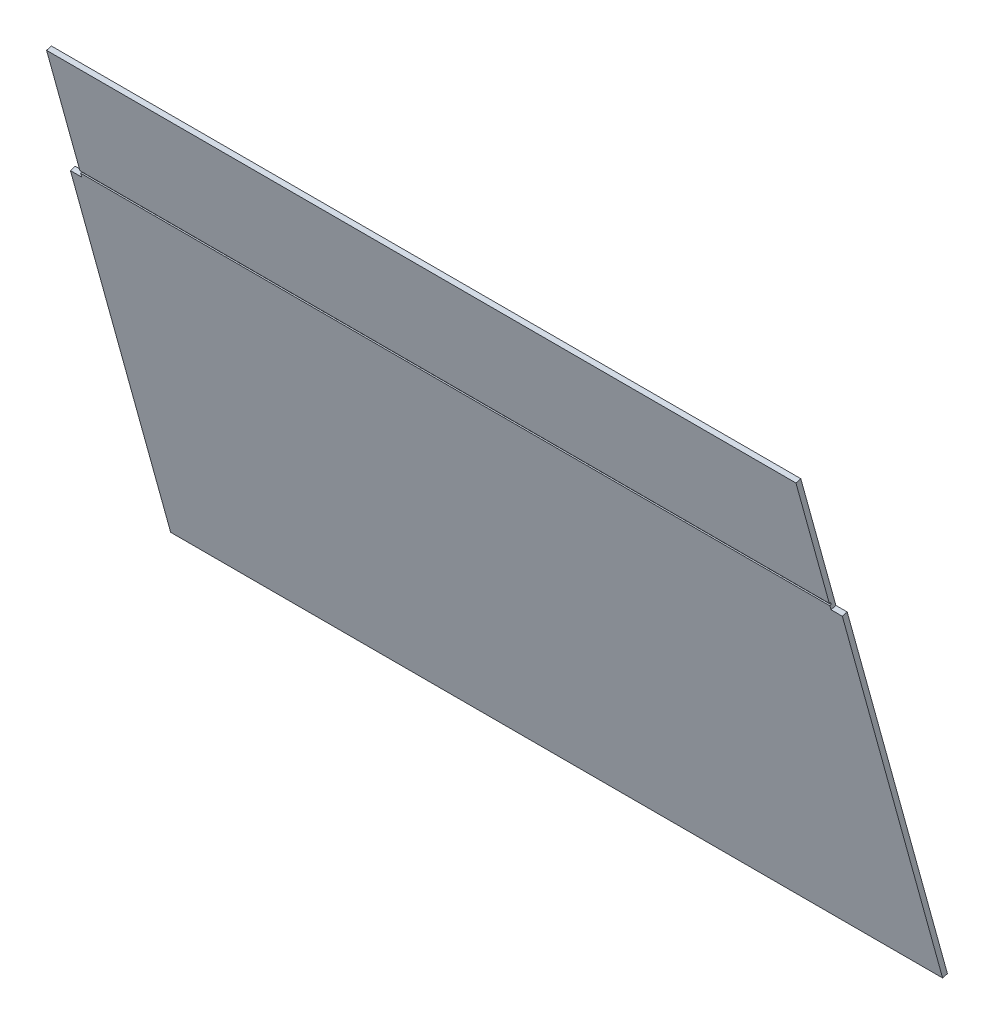
ISO-10303-21;
HEADER;
FILE_DESCRIPTION(('STEP AP214'),'2;1');
FILE_NAME('part.step','',(''),(''),'','','');
FILE_SCHEMA(('AUTOMOTIVE_DESIGN { 1 0 10303 214 1 1 1 1 }'));
ENDSEC;
DATA;
#1=APPLICATION_CONTEXT('core data for automotive mechanical design processes');
#2=APPLICATION_PROTOCOL_DEFINITION('international standard','automotive_design',2000,#1);
#3=PRODUCT_CONTEXT('',#1,'mechanical');
#4=PRODUCT('Part','Part','',(#3));
#5=PRODUCT_RELATED_PRODUCT_CATEGORY('part','',(#4));
#6=PRODUCT_DEFINITION_FORMATION('','',#4);
#7=PRODUCT_DEFINITION_CONTEXT('part definition',#1,'design');
#8=PRODUCT_DEFINITION('design','',#6,#7);
#9=PRODUCT_DEFINITION_SHAPE('','',#8);
#10=(LENGTH_UNIT() NAMED_UNIT(*) SI_UNIT(.MILLI.,.METRE.));
#11=(NAMED_UNIT(*) PLANE_ANGLE_UNIT() SI_UNIT($,.RADIAN.));
#12=(NAMED_UNIT(*) SI_UNIT($,.STERADIAN.) SOLID_ANGLE_UNIT());
#13=UNCERTAINTY_MEASURE_WITH_UNIT(LENGTH_MEASURE(1.E-05),#10,'distance_accuracy_value','');
#14=(GEOMETRIC_REPRESENTATION_CONTEXT(3) GLOBAL_UNCERTAINTY_ASSIGNED_CONTEXT((#13)) GLOBAL_UNIT_ASSIGNED_CONTEXT((#10,
#11,#12)) REPRESENTATION_CONTEXT('',''));
#15=CARTESIAN_POINT('',(0.,0.,0.));
#16=DIRECTION('',(0.,0.,1.));
#17=DIRECTION('',(1.,0.,0.));
#18=AXIS2_PLACEMENT_3D('',#15,#16,#17);
#19=CARTESIAN_POINT('',(0.,-93.0040926538124,-89.4892260480927));
#20=DIRECTION('',(0.,0.265928998125811,-0.963992618206074));
#21=DIRECTION('',(0.,0.963992618206074,0.265928998125811));
#22=AXIS2_PLACEMENT_3D('',#19,#20,#21);
#23=PLANE('',#22);
#24=DIRECTION('',(0.,0.963992618206074,0.265928998125811));
#25=VECTOR('',#24,1.);
#26=CARTESIAN_POINT('',(-149.5,-93.0040926538124,-89.4892260480927));
#27=LINE('',#26,#25);
#28=CARTESIAN_POINT('',(-149.5,-209.481286841723,-121.620865824068));
#29=VERTEX_POINT('',#28);
#30=CARTESIAN_POINT('',(-149.5,-161.212837478994,-108.305431517108));
#31=VERTEX_POINT('',#30);
#32=EDGE_CURVE('E75',#29,#31,#27,.T.);
#33=ORIENTED_EDGE('',*,*,#32,.F.);
#34=DIRECTION('',(-1.,0.,0.));
#35=VECTOR('',#34,1.);
#36=CARTESIAN_POINT('',(149.499999999992,-209.481286841723,-121.620865824068));
#37=LINE('',#36,#35);
#38=CARTESIAN_POINT('',(149.499999999992,-209.481286841723,-121.620865824068));
#39=VERTEX_POINT('',#38);
#40=EDGE_CURVE('E145',#39,#29,#37,.T.);
#41=ORIENTED_EDGE('',*,*,#40,.F.);
#42=DIRECTION('',(0.,0.963992618206074,0.265928998125811));
#43=VECTOR('',#42,1.);
#44=CARTESIAN_POINT('',(149.5,-93.0040926538124,-89.4892260480927));
#45=LINE('',#44,#43);
#46=CARTESIAN_POINT('',(149.5,-161.212837478994,-108.305431517108));
#47=VERTEX_POINT('',#46);
#48=EDGE_CURVE('E227',#39,#47,#45,.T.);
#49=ORIENTED_EDGE('',*,*,#48,.T.);
#50=DIRECTION('',(1.,0.,0.));
#51=VECTOR('',#50,1.);
#52=CARTESIAN_POINT('',(0.,-161.212837478994,-108.305431517108));
#53=LINE('',#52,#51);
#54=EDGE_CURVE('E228',#47,#31,#53,.F.);
#55=ORIENTED_EDGE('',*,*,#54,.T.);
#56=EDGE_LOOP('',(#33,#41,#49,#55));
#57=FACE_BOUND('',#56,.T.);
#58=ADVANCED_FACE('F39',(#57),#23,.F.);
#59=CARTESIAN_POINT('',(-154.,-160.680979482742,-110.23341675352));
#60=DIRECTION('',(0.,-0.963992618206074,-0.265928998125811));
#61=DIRECTION('',(-1.,0.,0.));
#62=AXIS2_PLACEMENT_3D('',#59,#60,#61);
#63=PLANE('',#62);
#64=DIRECTION('',(0.,0.265928998125811,-0.963992618206074));
#65=VECTOR('',#64,1.);
#66=CARTESIAN_POINT('',(-149.5,-160.680979482742,-110.23341675352));
#67=LINE('',#66,#65);
#68=CARTESIAN_POINT('',(-149.5,-160.680979482742,-110.23341675352));
#69=VERTEX_POINT('',#68);
#70=EDGE_CURVE('E12',#31,#69,#67,.T.);
#71=ORIENTED_EDGE('',*,*,#70,.F.);
#72=ORIENTED_EDGE('',*,*,#54,.F.);
#73=DIRECTION('',(0.,0.265928998125811,-0.963992618206074));
#74=VECTOR('',#73,1.);
#75=CARTESIAN_POINT('',(149.5,-160.680979482742,-110.23341675352));
#76=LINE('',#75,#74);
#77=CARTESIAN_POINT('',(149.5,-160.680979482742,-110.23341675352));
#78=VERTEX_POINT('',#77);
#79=EDGE_CURVE('E47',#47,#78,#76,.T.);
#80=ORIENTED_EDGE('',*,*,#79,.T.);
#81=DIRECTION('',(-1.,0.,0.));
#82=VECTOR('',#81,1.);
#83=CARTESIAN_POINT('',(-154.,-160.680979482742,-110.23341675352));
#84=LINE('',#83,#82);
#85=EDGE_CURVE('E220',#78,#69,#84,.T.);
#86=ORIENTED_EDGE('',*,*,#85,.T.);
#87=EDGE_LOOP('',(#71,#72,#80,#86));
#88=FACE_BOUND('',#87,.T.);
#89=ADVANCED_FACE('F253',(#88),#63,.F.);
#90=CARTESIAN_POINT('',(149.5,-208.335749176123,-123.379560117212));
#91=DIRECTION('',(-1.,0.,0.));
#92=DIRECTION('',(0.,0.963992618206074,0.265928998125811));
#93=AXIS2_PLACEMENT_3D('',#90,#91,#92);
#94=PLANE('',#93);
#95=DIRECTION('',(0.,-0.265928998125811,0.963992618206074));
#96=VECTOR('',#95,1.);
#97=CARTESIAN_POINT('',(149.499999999992,-209.34832234266,-122.102862133171));
#98=LINE('',#97,#96);
#99=CARTESIAN_POINT('',(149.499999999992,-209.34832234266,-122.102862133171));
#100=VERTEX_POINT('',#99);
#101=EDGE_CURVE('E142',#100,#39,#98,.T.);
#102=ORIENTED_EDGE('',*,*,#101,.F.);
#103=DIRECTION('',(0.,0.963992618206074,0.265928998125811));
#104=VECTOR('',#103,1.);
#105=CARTESIAN_POINT('',(149.499999999992,-210.312314960867,-122.368791131297));
#106=LINE('',#105,#104);
#107=CARTESIAN_POINT('',(149.499999999992,-210.312314960867,-122.368791131297));
#108=VERTEX_POINT('',#107);
#109=EDGE_CURVE('E161',#108,#100,#106,.T.);
#110=ORIENTED_EDGE('',*,*,#109,.F.);
#111=DIRECTION('',(0.,-0.265928998125811,0.963992618206074));
#112=VECTOR('',#111,1.);
#113=CARTESIAN_POINT('',(149.499999999992,-210.312314960867,-122.368791131297));
#114=LINE('',#113,#112);
#115=CARTESIAN_POINT('',(149.499999999992,-210.445279459929,-121.886794822194));
#116=VERTEX_POINT('',#115);
#117=EDGE_CURVE('E152',#108,#116,#114,.T.);
#118=ORIENTED_EDGE('',*,*,#117,.T.);
#119=CARTESIAN_POINT('',(149.5,-212.022951747484,-122.322014763588));
#120=VERTEX_POINT('',#119);
#121=EDGE_CURVE('E221',#120,#116,#45,.T.);
#122=ORIENTED_EDGE('',*,*,#121,.F.);
#123=DIRECTION('',(0.,0.265928998125814,-0.963992618206074));
#124=VECTOR('',#123,1.);
#125=CARTESIAN_POINT('',(149.5,-211.491093751232,-124.25));
#126=LINE('',#125,#124);
#127=CARTESIAN_POINT('',(149.5,-211.491093751232,-124.25));
#128=VERTEX_POINT('',#127);
#129=EDGE_CURVE('E188',#120,#128,#126,.T.);
#130=ORIENTED_EDGE('',*,*,#129,.T.);
#131=DIRECTION('',(0.,0.963992618206074,0.265928998125811));
#132=VECTOR('',#131,1.);
#133=CARTESIAN_POINT('',(149.5,-208.335749176123,-123.379560117212));
#134=LINE('',#133,#132);
#135=EDGE_CURVE('E223',#128,#78,#134,.T.);
#136=ORIENTED_EDGE('',*,*,#135,.T.);
#137=ORIENTED_EDGE('',*,*,#79,.F.);
#138=ORIENTED_EDGE('',*,*,#48,.F.);
#139=EDGE_LOOP('',(#102,#110,#118,#122,#130,#136,#137,#138));
#140=FACE_BOUND('',#139,.T.);
#141=ADVANCED_FACE('F165',(#140),#94,.F.);
#142=CARTESIAN_POINT('',(-149.5,-208.335749176123,-123.379560117212));
#143=DIRECTION('',(-1.,0.,0.));
#144=DIRECTION('',(0.,0.963992618206074,0.265928998125811));
#145=AXIS2_PLACEMENT_3D('',#142,#143,#144);
#146=PLANE('',#145);
#147=DIRECTION('',(0.,-0.265928998125811,0.963992618206074));
#148=VECTOR('',#147,1.);
#149=CARTESIAN_POINT('',(-149.5,-209.348322342661,-122.102862133171));
#150=LINE('',#149,#148);
#151=CARTESIAN_POINT('',(-149.5,-209.348322342661,-122.102862133171));
#152=VERTEX_POINT('',#151);
#153=EDGE_CURVE('E131',#152,#29,#150,.T.);
#154=ORIENTED_EDGE('',*,*,#153,.T.);
#155=ORIENTED_EDGE('',*,*,#32,.T.);
#156=ORIENTED_EDGE('',*,*,#70,.T.);
#157=DIRECTION('',(0.,0.963992618206074,0.265928998125811));
#158=VECTOR('',#157,1.);
#159=CARTESIAN_POINT('',(-149.5,-208.335749176123,-123.379560117212));
#160=LINE('',#159,#158);
#161=CARTESIAN_POINT('',(-149.5,-211.491093751232,-124.25));
#162=VERTEX_POINT('',#161);
#163=EDGE_CURVE('E217',#162,#69,#160,.T.);
#164=ORIENTED_EDGE('',*,*,#163,.F.);
#165=DIRECTION('',(0.,0.265928998125814,-0.963992618206074));
#166=VECTOR('',#165,1.);
#167=CARTESIAN_POINT('',(-149.5,-211.491093751232,-124.25));
#168=LINE('',#167,#166);
#169=CARTESIAN_POINT('',(-149.5,-212.022951747484,-122.322014763588));
#170=VERTEX_POINT('',#169);
#171=EDGE_CURVE('E197',#170,#162,#168,.T.);
#172=ORIENTED_EDGE('',*,*,#171,.F.);
#173=CARTESIAN_POINT('',(-149.5,-210.445279459929,-121.886794822194));
#174=VERTEX_POINT('',#173);
#175=EDGE_CURVE('E83',#170,#174,#27,.T.);
#176=ORIENTED_EDGE('',*,*,#175,.T.);
#177=DIRECTION('',(0.,-0.265928998125811,0.963992618206074));
#178=VECTOR('',#177,1.);
#179=CARTESIAN_POINT('',(-149.5,-210.312314960867,-122.368791131297));
#180=LINE('',#179,#178);
#181=CARTESIAN_POINT('',(-149.5,-210.312314960867,-122.368791131297));
#182=VERTEX_POINT('',#181);
#183=EDGE_CURVE('E54',#182,#174,#180,.T.);
#184=ORIENTED_EDGE('',*,*,#183,.F.);
#185=DIRECTION('',(0.,-0.963992618206072,-0.265928998125818));
#186=VECTOR('',#185,1.);
#187=CARTESIAN_POINT('',(-149.5,-210.312314960867,-122.368791131297));
#188=LINE('',#187,#186);
#189=EDGE_CURVE('E163',#152,#182,#188,.T.);
#190=ORIENTED_EDGE('',*,*,#189,.F.);
#191=EDGE_LOOP('',(#154,#155,#156,#164,#172,#176,#184,#190));
#192=FACE_BOUND('',#191,.T.);
#193=ADVANCED_FACE('F231',(#192),#146,.T.);
#194=CARTESIAN_POINT('',(0.,16.8956574584764,-61.246758286977));
#195=DIRECTION('',(0.,-0.265928998125814,0.963992618206074));
#196=DIRECTION('',(0.,-0.963992618206074,-0.265928998125814));
#197=AXIS2_PLACEMENT_3D('',#194,#195,#196);
#198=PLANE('',#197);
#199=ORIENTED_EDGE('',*,*,#135,.F.);
#200=DIRECTION('',(1.,0.,0.));
#201=VECTOR('',#200,1.);
#202=CARTESIAN_POINT('',(149.5,-211.491093751232,-124.25));
#203=LINE('',#202,#201);
#204=CARTESIAN_POINT('',(154.,-211.491093751232,-124.25));
#205=VERTEX_POINT('',#204);
#206=EDGE_CURVE('E191',#128,#205,#203,.T.);
#207=ORIENTED_EDGE('',*,*,#206,.T.);
#208=DIRECTION('',(0.,0.963992618206074,0.265928998125814));
#209=VECTOR('',#208,1.);
#210=CARTESIAN_POINT('',(154.,-211.491093751232,-124.25));
#211=LINE('',#210,#209);
#212=CARTESIAN_POINT('',(154.,-356.491093751232,-164.25));
#213=VERTEX_POINT('',#212);
#214=EDGE_CURVE('E205',#213,#205,#211,.T.);
#215=ORIENTED_EDGE('',*,*,#214,.F.);
#216=DIRECTION('',(1.,0.,0.));
#217=VECTOR('',#216,1.);
#218=CARTESIAN_POINT('',(-154.,-356.491093751232,-164.25));
#219=LINE('',#218,#217);
#220=CARTESIAN_POINT('',(-154.,-356.491093751232,-164.25));
#221=VERTEX_POINT('',#220);
#222=EDGE_CURVE('E210',#221,#213,#219,.T.);
#223=ORIENTED_EDGE('',*,*,#222,.F.);
#224=DIRECTION('',(0.,-0.963992618206074,-0.265928998125814));
#225=VECTOR('',#224,1.);
#226=CARTESIAN_POINT('',(-154.,-211.491093751232,-124.25));
#227=LINE('',#226,#225);
#228=CARTESIAN_POINT('',(-154.,-211.491093751232,-124.25));
#229=VERTEX_POINT('',#228);
#230=EDGE_CURVE('E214',#229,#221,#227,.T.);
#231=ORIENTED_EDGE('',*,*,#230,.F.);
#232=DIRECTION('',(-1.,0.,0.));
#233=VECTOR('',#232,1.);
#234=CARTESIAN_POINT('',(-149.5,-211.491093751232,-124.25));
#235=LINE('',#234,#233);
#236=EDGE_CURVE('E194',#162,#229,#235,.T.);
#237=ORIENTED_EDGE('',*,*,#236,.F.);
#238=ORIENTED_EDGE('',*,*,#163,.T.);
#239=ORIENTED_EDGE('',*,*,#85,.F.);
#240=EDGE_LOOP('',(#199,#207,#215,#223,#231,#237,#238,#239));
#241=FACE_BOUND('',#240,.T.);
#242=ADVANCED_FACE('F41',(#241),#198,.F.);
#243=ORIENTED_EDGE('',*,*,#121,.T.);
#244=DIRECTION('',(1.,0.,0.));
#245=VECTOR('',#244,1.);
#246=CARTESIAN_POINT('',(149.499999999992,-210.445279459929,-121.886794822194));
#247=LINE('',#246,#245);
#248=EDGE_CURVE('E154',#174,#116,#247,.T.);
#249=ORIENTED_EDGE('',*,*,#248,.F.);
#250=ORIENTED_EDGE('',*,*,#175,.F.);
#251=DIRECTION('',(1.,0.,0.));
#252=VECTOR('',#251,1.);
#253=CARTESIAN_POINT('',(0.,-212.022951747484,-122.322014763588));
#254=LINE('',#253,#252);
#255=CARTESIAN_POINT('',(-154.,-212.022951747484,-122.322014763588));
#256=VERTEX_POINT('',#255);
#257=EDGE_CURVE('E186',#170,#256,#254,.F.);
#258=ORIENTED_EDGE('',*,*,#257,.T.);
#259=DIRECTION('',(0.,-0.963992618206074,-0.265928998125814));
#260=VECTOR('',#259,1.);
#261=CARTESIAN_POINT('',(-154.,16.3637994622248,-59.3187730505648));
#262=LINE('',#261,#260);
#263=CARTESIAN_POINT('',(-154.,-357.022951747484,-162.322014763588));
#264=VERTEX_POINT('',#263);
#265=EDGE_CURVE('E184',#256,#264,#262,.T.);
#266=ORIENTED_EDGE('',*,*,#265,.T.);
#267=DIRECTION('',(1.,0.,0.));
#268=VECTOR('',#267,1.);
#269=CARTESIAN_POINT('',(0.,-357.022951747484,-162.322014763588));
#270=LINE('',#269,#268);
#271=CARTESIAN_POINT('',(154.,-357.022951747484,-162.322014763588));
#272=VERTEX_POINT('',#271);
#273=EDGE_CURVE('E181',#264,#272,#270,.T.);
#274=ORIENTED_EDGE('',*,*,#273,.T.);
#275=DIRECTION('',(0.,-0.963992618206074,-0.265928998125814));
#276=VECTOR('',#275,1.);
#277=CARTESIAN_POINT('',(154.,16.3637994622248,-59.3187730505648));
#278=LINE('',#277,#276);
#279=CARTESIAN_POINT('',(154.,-212.022951747484,-122.322014763588));
#280=VERTEX_POINT('',#279);
#281=EDGE_CURVE('E178',#272,#280,#278,.F.);
#282=ORIENTED_EDGE('',*,*,#281,.T.);
#283=DIRECTION('',(1.,0.,0.));
#284=VECTOR('',#283,1.);
#285=CARTESIAN_POINT('',(0.,-212.022951747484,-122.322014763588));
#286=LINE('',#285,#284);
#287=EDGE_CURVE('E202',#120,#280,#286,.T.);
#288=ORIENTED_EDGE('',*,*,#287,.F.);
#289=EDGE_LOOP('',(#243,#249,#250,#258,#266,#274,#282,#288));
#290=FACE_BOUND('',#289,.T.);
#291=ADVANCED_FACE('F236',(#290),#23,.F.);
#292=CARTESIAN_POINT('',(-154.,-211.491093751232,-124.25));
#293=DIRECTION('',(-1.,0.,0.));
#294=DIRECTION('',(0.,-0.963992618206074,-0.265928998125814));
#295=AXIS2_PLACEMENT_3D('',#292,#293,#294);
#296=PLANE('',#295);
#297=DIRECTION('',(0.,0.265928998125814,-0.963992618206074));
#298=VECTOR('',#297,1.);
#299=CARTESIAN_POINT('',(-154.,-356.491093751232,-164.25));
#300=LINE('',#299,#298);
#301=EDGE_CURVE('E123',#264,#221,#300,.T.);
#302=ORIENTED_EDGE('',*,*,#301,.F.);
#303=ORIENTED_EDGE('',*,*,#265,.F.);
#304=DIRECTION('',(0.,0.265928998125814,-0.963992618206074));
#305=VECTOR('',#304,1.);
#306=CARTESIAN_POINT('',(-154.,-211.491093751232,-124.25));
#307=LINE('',#306,#305);
#308=EDGE_CURVE('E175',#256,#229,#307,.T.);
#309=ORIENTED_EDGE('',*,*,#308,.T.);
#310=ORIENTED_EDGE('',*,*,#230,.T.);
#311=EDGE_LOOP('',(#302,#303,#309,#310));
#312=FACE_BOUND('',#311,.T.);
#313=ADVANCED_FACE('F238',(#312),#296,.T.);
#314=CARTESIAN_POINT('',(-154.,-356.491093751232,-164.25));
#315=DIRECTION('',(0.,-0.963992618206074,-0.265928998125814));
#316=DIRECTION('',(1.,0.,0.));
#317=AXIS2_PLACEMENT_3D('',#314,#315,#316);
#318=PLANE('',#317);
#319=DIRECTION('',(0.,0.265928998125814,-0.963992618206074));
#320=VECTOR('',#319,1.);
#321=CARTESIAN_POINT('',(154.,-356.491093751232,-164.25));
#322=LINE('',#321,#320);
#323=EDGE_CURVE('E208',#272,#213,#322,.T.);
#324=ORIENTED_EDGE('',*,*,#323,.F.);
#325=ORIENTED_EDGE('',*,*,#273,.F.);
#326=ORIENTED_EDGE('',*,*,#301,.T.);
#327=ORIENTED_EDGE('',*,*,#222,.T.);
#328=EDGE_LOOP('',(#324,#325,#326,#327));
#329=FACE_BOUND('',#328,.T.);
#330=ADVANCED_FACE('F244',(#329),#318,.T.);
#331=CARTESIAN_POINT('',(154.,-211.491093751232,-124.25));
#332=DIRECTION('',(1.,0.,0.));
#333=DIRECTION('',(0.,0.963992618206074,0.265928998125814));
#334=AXIS2_PLACEMENT_3D('',#331,#332,#333);
#335=PLANE('',#334);
#336=DIRECTION('',(0.,0.265928998125814,-0.963992618206074));
#337=VECTOR('',#336,1.);
#338=CARTESIAN_POINT('',(154.,-211.491093751232,-124.25));
#339=LINE('',#338,#337);
#340=EDGE_CURVE('E200',#280,#205,#339,.T.);
#341=ORIENTED_EDGE('',*,*,#340,.F.);
#342=ORIENTED_EDGE('',*,*,#281,.F.);
#343=ORIENTED_EDGE('',*,*,#323,.T.);
#344=ORIENTED_EDGE('',*,*,#214,.T.);
#345=EDGE_LOOP('',(#341,#342,#343,#344));
#346=FACE_BOUND('',#345,.T.);
#347=ADVANCED_FACE('F248',(#346),#335,.T.);
#348=CARTESIAN_POINT('',(149.5,-211.491093751232,-124.25));
#349=DIRECTION('',(0.,-0.963992618206074,-0.265928998125814));
#350=DIRECTION('',(1.,0.,0.));
#351=AXIS2_PLACEMENT_3D('',#348,#349,#350);
#352=PLANE('',#351);
#353=ORIENTED_EDGE('',*,*,#129,.F.);
#354=ORIENTED_EDGE('',*,*,#287,.T.);
#355=ORIENTED_EDGE('',*,*,#340,.T.);
#356=ORIENTED_EDGE('',*,*,#206,.F.);
#357=EDGE_LOOP('',(#353,#354,#355,#356));
#358=FACE_BOUND('',#357,.T.);
#359=ADVANCED_FACE('F252',(#358),#352,.F.);
#360=CARTESIAN_POINT('',(-149.5,-211.491093751232,-124.25));
#361=DIRECTION('',(0.,0.963992618206074,0.265928998125814));
#362=DIRECTION('',(-1.,0.,0.));
#363=AXIS2_PLACEMENT_3D('',#360,#361,#362);
#364=PLANE('',#363);
#365=ORIENTED_EDGE('',*,*,#308,.F.);
#366=ORIENTED_EDGE('',*,*,#257,.F.);
#367=ORIENTED_EDGE('',*,*,#171,.T.);
#368=ORIENTED_EDGE('',*,*,#236,.T.);
#369=EDGE_LOOP('',(#365,#366,#367,#368));
#370=FACE_BOUND('',#369,.T.);
#371=ADVANCED_FACE('F235',(#370),#364,.T.);
#372=CARTESIAN_POINT('',(149.499999999992,-209.34832234266,-122.102862133171));
#373=DIRECTION('',(0.,0.963992618206074,0.265928998125811));
#374=DIRECTION('',(0.,-0.265928998125811,0.963992618206075));
#375=AXIS2_PLACEMENT_3D('',#372,#373,#374);
#376=PLANE('',#375);
#377=ORIENTED_EDGE('',*,*,#40,.T.);
#378=ORIENTED_EDGE('',*,*,#153,.F.);
#379=DIRECTION('',(-1.,0.,0.));
#380=VECTOR('',#379,1.);
#381=CARTESIAN_POINT('',(149.499999999992,-209.34832234266,-122.102862133171));
#382=LINE('',#381,#380);
#383=EDGE_CURVE('E167',#100,#152,#382,.T.);
#384=ORIENTED_EDGE('',*,*,#383,.F.);
#385=ORIENTED_EDGE('',*,*,#101,.T.);
#386=EDGE_LOOP('',(#377,#378,#384,#385));
#387=FACE_BOUND('',#386,.T.);
#388=ADVANCED_FACE('F334',(#387),#376,.F.);
#389=CARTESIAN_POINT('',(149.499999999992,-210.312314960867,-122.368791131297));
#390=DIRECTION('',(0.,-0.963992618206074,-0.265928998125811));
#391=DIRECTION('',(0.,0.265928998125811,-0.963992618206075));
#392=AXIS2_PLACEMENT_3D('',#389,#390,#391);
#393=PLANE('',#392);
#394=ORIENTED_EDGE('',*,*,#248,.T.);
#395=ORIENTED_EDGE('',*,*,#117,.F.);
#396=DIRECTION('',(1.,0.,0.));
#397=VECTOR('',#396,1.);
#398=CARTESIAN_POINT('',(149.499999999992,-210.312314960867,-122.368791131297));
#399=LINE('',#398,#397);
#400=EDGE_CURVE('E149',#182,#108,#399,.T.);
#401=ORIENTED_EDGE('',*,*,#400,.F.);
#402=ORIENTED_EDGE('',*,*,#183,.T.);
#403=EDGE_LOOP('',(#394,#395,#401,#402));
#404=FACE_BOUND('',#403,.T.);
#405=ADVANCED_FACE('F153',(#404),#393,.F.);
#406=CARTESIAN_POINT('',(0.,16.4967639612877,-59.8007693596668));
#407=DIRECTION('',(0.,-0.265928998125818,0.963992618206073));
#408=DIRECTION('',(0.,-0.963992618206073,-0.265928998125818));
#409=AXIS2_PLACEMENT_3D('',#406,#407,#408);
#410=PLANE('',#409);
#411=ORIENTED_EDGE('',*,*,#189,.T.);
#412=ORIENTED_EDGE('',*,*,#400,.T.);
#413=ORIENTED_EDGE('',*,*,#109,.T.);
#414=ORIENTED_EDGE('',*,*,#383,.T.);
#415=EDGE_LOOP('',(#411,#412,#413,#414));
#416=FACE_BOUND('',#415,.T.);
#417=ADVANCED_FACE('F160',(#416),#410,.T.);
#418=CLOSED_SHELL('',(#58,#89,#141,#193,#242,#291,#313,#330,#347,#359,#371,#388,#405,#417));
#419=MANIFOLD_SOLID_BREP('B2',#418);
#420=ADVANCED_BREP_SHAPE_REPRESENTATION('',(#18,#419),#14);
#421=SHAPE_DEFINITION_REPRESENTATION(#9,#420);
ENDSEC;
END-ISO-10303-21;
